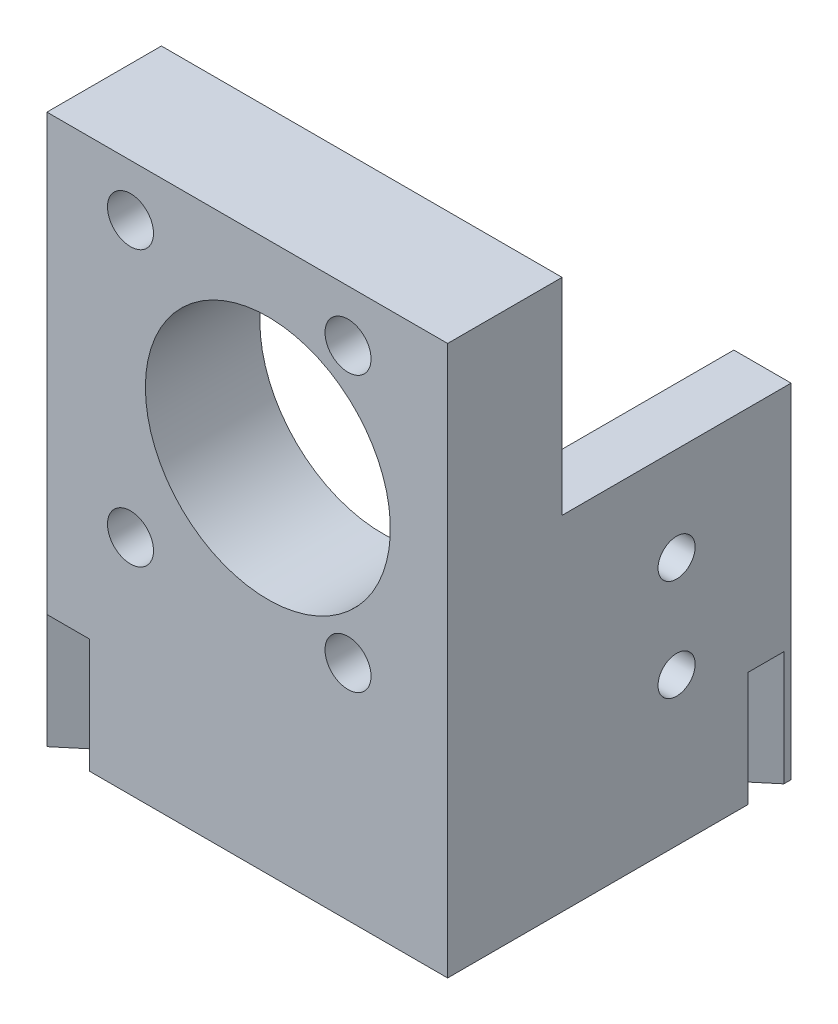
ISO-10303-21;
HEADER;
FILE_DESCRIPTION(('STEP AP214'),'2;1');
FILE_NAME('part.step','',(''),(''),'','','');
FILE_SCHEMA(('AUTOMOTIVE_DESIGN { 1 0 10303 214 1 1 1 1 }'));
ENDSEC;
DATA;
#1=APPLICATION_CONTEXT('core data for automotive mechanical design processes');
#2=APPLICATION_PROTOCOL_DEFINITION('international standard','automotive_design',2000,#1);
#3=PRODUCT_CONTEXT('',#1,'mechanical');
#4=PRODUCT('Part','Part','',(#3));
#5=PRODUCT_RELATED_PRODUCT_CATEGORY('part','',(#4));
#6=PRODUCT_DEFINITION_FORMATION('','',#4);
#7=PRODUCT_DEFINITION_CONTEXT('part definition',#1,'design');
#8=PRODUCT_DEFINITION('design','',#6,#7);
#9=PRODUCT_DEFINITION_SHAPE('','',#8);
#10=(LENGTH_UNIT() NAMED_UNIT(*) SI_UNIT(.MILLI.,.METRE.));
#11=(NAMED_UNIT(*) PLANE_ANGLE_UNIT() SI_UNIT($,.RADIAN.));
#12=(NAMED_UNIT(*) SI_UNIT($,.STERADIAN.) SOLID_ANGLE_UNIT());
#13=UNCERTAINTY_MEASURE_WITH_UNIT(LENGTH_MEASURE(1.E-05),#10,'distance_accuracy_value','');
#14=(GEOMETRIC_REPRESENTATION_CONTEXT(3) GLOBAL_UNCERTAINTY_ASSIGNED_CONTEXT((#13)) GLOBAL_UNIT_ASSIGNED_CONTEXT((#10,
#11,#12)) REPRESENTATION_CONTEXT('',''));
#15=CARTESIAN_POINT('',(0.,0.,0.));
#16=DIRECTION('',(0.,0.,1.));
#17=DIRECTION('',(1.,0.,0.));
#18=AXIS2_PLACEMENT_3D('',#15,#16,#17);
#19=CARTESIAN_POINT('',(0.,0.,0.));
#20=DIRECTION('',(0.,1.,0.));
#21=DIRECTION('',(0.,0.,1.));
#22=AXIS2_PLACEMENT_3D('',#19,#20,#21);
#23=PLANE('',#22);
#24=DIRECTION('',(1.,0.,0.));
#25=VECTOR('',#24,1.);
#26=CARTESIAN_POINT('',(-44.45,0.,0.));
#27=LINE('',#26,#25);
#28=CARTESIAN_POINT('',(-39.7081537757294,0.,0.));
#29=VERTEX_POINT('',#28);
#30=CARTESIAN_POINT('',(0.,0.,0.));
#31=VERTEX_POINT('',#30);
#32=EDGE_CURVE('E216',#29,#31,#27,.T.);
#33=ORIENTED_EDGE('',*,*,#32,.F.);
#34=DIRECTION('',(0.766044443118982,0.,-0.642787609686534));
#35=VECTOR('',#34,1.);
#36=CARTESIAN_POINT('',(-16.4064526170276,0.,-19.5524488480696));
#37=LINE('',#36,#35);
#38=CARTESIAN_POINT('',(-24.5728831497828,0.,-12.7));
#39=VERTEX_POINT('',#38);
#40=EDGE_CURVE('E43',#29,#39,#37,.T.);
#41=ORIENTED_EDGE('',*,*,#40,.T.);
#42=DIRECTION('',(-1.,0.,0.));
#43=VECTOR('',#42,1.);
#44=CARTESIAN_POINT('',(-6.35000000000001,0.,-12.7));
#45=LINE('',#44,#43);
#46=CARTESIAN_POINT('',(-6.35000000000001,0.,-12.7));
#47=VERTEX_POINT('',#46);
#48=EDGE_CURVE('E221',#47,#39,#45,.T.);
#49=ORIENTED_EDGE('',*,*,#48,.F.);
#50=DIRECTION('',(0.,0.,1.));
#51=VECTOR('',#50,1.);
#52=CARTESIAN_POINT('',(-6.35,0.,-38.1));
#53=LINE('',#52,#51);
#54=CARTESIAN_POINT('',(-6.35,0.,-27.9908145299692));
#55=VERTEX_POINT('',#54);
#56=EDGE_CURVE('E169',#55,#47,#53,.T.);
#57=ORIENTED_EDGE('',*,*,#56,.F.);
#58=CARTESIAN_POINT('',(0.,0.,-33.3190971879449));
#59=VERTEX_POINT('',#58);
#60=EDGE_CURVE('E193',#55,#59,#37,.T.);
#61=ORIENTED_EDGE('',*,*,#60,.T.);
#62=DIRECTION('',(0.,0.,-1.));
#63=VECTOR('',#62,1.);
#64=CARTESIAN_POINT('',(0.,0.,0.));
#65=LINE('',#64,#63);
#66=EDGE_CURVE('E212',#31,#59,#65,.T.);
#67=ORIENTED_EDGE('',*,*,#66,.F.);
#68=EDGE_LOOP('',(#33,#41,#49,#57,#61,#67));
#69=FACE_BOUND('',#68,.T.);
#70=ADVANCED_FACE('F35',(#69),#23,.F.);
#71=CARTESIAN_POINT('',(0.,0.,-37.2979786058297));
#72=VERTEX_POINT('',#71);
#73=CARTESIAN_POINT('',(0.,0.,-38.1));
#74=VERTEX_POINT('',#73);
#75=EDGE_CURVE('E206',#72,#74,#65,.T.);
#76=ORIENTED_EDGE('',*,*,#75,.F.);
#77=DIRECTION('',(-0.766044443118982,0.,0.642787609686535));
#78=VECTOR('',#77,1.);
#79=CARTESIAN_POINT('',(-18.3656692513522,0.,-21.8873523106963));
#80=LINE('',#79,#78);
#81=CARTESIAN_POINT('',(-6.35,0.,-31.969695947854));
#82=VERTEX_POINT('',#81);
#83=EDGE_CURVE('E192',#72,#82,#80,.T.);
#84=ORIENTED_EDGE('',*,*,#83,.T.);
#85=CARTESIAN_POINT('',(-6.35,0.,-38.1));
#86=VERTEX_POINT('',#85);
#87=EDGE_CURVE('E178',#86,#82,#53,.T.);
#88=ORIENTED_EDGE('',*,*,#87,.F.);
#89=DIRECTION('',(-1.,0.,0.));
#90=VECTOR('',#89,1.);
#91=CARTESIAN_POINT('',(0.,0.,-38.1));
#92=LINE('',#91,#90);
#93=EDGE_CURVE('E211',#74,#86,#92,.T.);
#94=ORIENTED_EDGE('',*,*,#93,.F.);
#95=EDGE_LOOP('',(#76,#84,#88,#94));
#96=FACE_BOUND('',#95,.T.);
#97=ADVANCED_FACE('F203',(#96),#23,.F.);
#98=CARTESIAN_POINT('',(-6.35000000000001,60.96,-12.7));
#99=DIRECTION('',(0.,0.,1.));
#100=DIRECTION('',(1.,0.,0.));
#101=AXIS2_PLACEMENT_3D('',#98,#99,#100);
#102=PLANE('',#101);
#103=CARTESIAN_POINT('',(-35.179,55.2196,-12.7));
#104=DIRECTION('',(0.,0.,1.));
#105=DIRECTION('',(1.,0.,0.));
#106=AXIS2_PLACEMENT_3D('',#103,#104,#105);
#107=CIRCLE('',#106,2.5527);
#108=CARTESIAN_POINT('',(-32.6263,55.2196,-12.7));
#109=VERTEX_POINT('',#108);
#110=EDGE_CURVE('E301',#109,#109,#107,.T.);
#111=ORIENTED_EDGE('',*,*,#110,.T.);
#112=EDGE_LOOP('',(#111));
#113=FACE_BOUND('',#112,.T.);
#114=CARTESIAN_POINT('',(-11.049,55.2196,-12.7));
#115=DIRECTION('',(0.,0.,1.));
#116=DIRECTION('',(1.,0.,0.));
#117=AXIS2_PLACEMENT_3D('',#114,#115,#116);
#118=CIRCLE('',#117,2.5527);
#119=CARTESIAN_POINT('',(-8.4963,55.2196,-12.7));
#120=VERTEX_POINT('',#119);
#121=EDGE_CURVE('E295',#120,#120,#118,.T.);
#122=ORIENTED_EDGE('',*,*,#121,.T.);
#123=EDGE_LOOP('',(#122));
#124=FACE_BOUND('',#123,.T.);
#125=CARTESIAN_POINT('',(-35.179,24.7396,-12.7));
#126=DIRECTION('',(0.,0.,1.));
#127=DIRECTION('',(1.,0.,0.));
#128=AXIS2_PLACEMENT_3D('',#125,#126,#127);
#129=CIRCLE('',#128,2.5527);
#130=CARTESIAN_POINT('',(-32.6263,24.7396,-12.7));
#131=VERTEX_POINT('',#130);
#132=EDGE_CURVE('E289',#131,#131,#129,.T.);
#133=ORIENTED_EDGE('',*,*,#132,.T.);
#134=EDGE_LOOP('',(#133));
#135=FACE_BOUND('',#134,.T.);
#136=CARTESIAN_POINT('',(-11.049,24.7396,-12.7));
#137=DIRECTION('',(0.,0.,1.));
#138=DIRECTION('',(1.,0.,0.));
#139=AXIS2_PLACEMENT_3D('',#136,#137,#138);
#140=CIRCLE('',#139,2.5527);
#141=CARTESIAN_POINT('',(-8.49630000000001,24.7396,-12.7));
#142=VERTEX_POINT('',#141);
#143=EDGE_CURVE('E164',#142,#142,#140,.T.);
#144=ORIENTED_EDGE('',*,*,#143,.T.);
#145=EDGE_LOOP('',(#144));
#146=FACE_BOUND('',#145,.T.);
#147=CARTESIAN_POINT('',(-19.939,39.9796,-12.7));
#148=DIRECTION('',(0.,0.,-1.));
#149=DIRECTION('',(-1.,0.,0.));
#150=AXIS2_PLACEMENT_3D('',#147,#148,#149);
#151=CIRCLE('',#150,13.589);
#152=CARTESIAN_POINT('',(-33.528,39.9796,-12.7));
#153=VERTEX_POINT('',#152);
#154=EDGE_CURVE('E239',#153,#153,#151,.T.);
#155=ORIENTED_EDGE('',*,*,#154,.F.);
#156=EDGE_LOOP('',(#155));
#157=FACE_BOUND('',#156,.T.);
#158=ORIENTED_EDGE('',*,*,#48,.T.);
#159=DIRECTION('',(0.,1.,0.));
#160=VECTOR('',#159,1.);
#161=CARTESIAN_POINT('',(-24.5728831497828,60.96,-12.7));
#162=LINE('',#161,#160);
#163=CARTESIAN_POINT('',(-24.5728831497828,12.7,-12.7));
#164=VERTEX_POINT('',#163);
#165=EDGE_CURVE('E253',#39,#164,#162,.T.);
#166=ORIENTED_EDGE('',*,*,#165,.T.);
#167=DIRECTION('',(-1.,0.,0.));
#168=VECTOR('',#167,1.);
#169=CARTESIAN_POINT('',(-6.35000000000001,12.7,-12.7));
#170=LINE('',#169,#168);
#171=CARTESIAN_POINT('',(-29.3147293740534,12.7,-12.7));
#172=VERTEX_POINT('',#171);
#173=EDGE_CURVE('E242',#164,#172,#170,.T.);
#174=ORIENTED_EDGE('',*,*,#173,.T.);
#175=DIRECTION('',(0.,-1.,0.));
#176=VECTOR('',#175,1.);
#177=CARTESIAN_POINT('',(-29.3147293740534,60.96,-12.7));
#178=LINE('',#177,#176);
#179=CARTESIAN_POINT('',(-29.3147293740534,0.,-12.7));
#180=VERTEX_POINT('',#179);
#181=EDGE_CURVE('E264',#172,#180,#178,.T.);
#182=ORIENTED_EDGE('',*,*,#181,.T.);
#183=CARTESIAN_POINT('',(-44.45,0.,-12.7));
#184=VERTEX_POINT('',#183);
#185=EDGE_CURVE('E222',#180,#184,#45,.T.);
#186=ORIENTED_EDGE('',*,*,#185,.T.);
#187=DIRECTION('',(0.,-1.,0.));
#188=VECTOR('',#187,1.);
#189=CARTESIAN_POINT('',(-44.45,60.96,-12.7));
#190=LINE('',#189,#188);
#191=CARTESIAN_POINT('',(-44.45,60.96,-12.7));
#192=VERTEX_POINT('',#191);
#193=EDGE_CURVE('E188',#192,#184,#190,.T.);
#194=ORIENTED_EDGE('',*,*,#193,.F.);
#195=DIRECTION('',(-1.,0.,0.));
#196=VECTOR('',#195,1.);
#197=CARTESIAN_POINT('',(-6.35000000000001,60.96,-12.7));
#198=LINE('',#197,#196);
#199=CARTESIAN_POINT('',(0.,60.96,-12.7));
#200=VERTEX_POINT('',#199);
#201=EDGE_CURVE('E209',#200,#192,#198,.T.);
#202=ORIENTED_EDGE('',*,*,#201,.F.);
#203=DIRECTION('',(0.,1.,0.));
#204=VECTOR('',#203,1.);
#205=CARTESIAN_POINT('',(0.,38.1,-12.7));
#206=LINE('',#205,#204);
#207=CARTESIAN_POINT('',(0.,38.1,-12.7));
#208=VERTEX_POINT('',#207);
#209=EDGE_CURVE('E152',#208,#200,#206,.T.);
#210=ORIENTED_EDGE('',*,*,#209,.F.);
#211=DIRECTION('',(1.,0.,0.));
#212=VECTOR('',#211,1.);
#213=CARTESIAN_POINT('',(-6.35000000000001,38.1,-12.7));
#214=LINE('',#213,#212);
#215=CARTESIAN_POINT('',(-6.35000000000001,38.1,-12.7));
#216=VERTEX_POINT('',#215);
#217=EDGE_CURVE('E149',#216,#208,#214,.T.);
#218=ORIENTED_EDGE('',*,*,#217,.F.);
#219=DIRECTION('',(0.,-1.,0.));
#220=VECTOR('',#219,1.);
#221=CARTESIAN_POINT('',(-6.35000000000001,60.96,-12.7));
#222=LINE('',#221,#220);
#223=EDGE_CURVE('E86',#216,#47,#222,.T.);
#224=ORIENTED_EDGE('',*,*,#223,.T.);
#225=EDGE_LOOP('',(#158,#166,#174,#182,#186,#194,#202,#210,#218,#224));
#226=FACE_BOUND('',#225,.T.);
#227=ADVANCED_FACE('F37',(#113,#124,#135,#146,#157,#226),#102,.F.);
#228=CARTESIAN_POINT('',(-44.45,60.96,-12.7));
#229=DIRECTION('',(1.,0.,0.));
#230=DIRECTION('',(0.,0.,-1.));
#231=AXIS2_PLACEMENT_3D('',#228,#229,#230);
#232=PLANE('',#231);
#233=DIRECTION('',(0.,0.,1.));
#234=VECTOR('',#233,1.);
#235=CARTESIAN_POINT('',(-44.45,0.,-12.7));
#236=LINE('',#235,#234);
#237=CARTESIAN_POINT('',(-44.45,0.,0.));
#238=VERTEX_POINT('',#237);
#239=EDGE_CURVE('E218',#184,#238,#236,.T.);
#240=ORIENTED_EDGE('',*,*,#239,.T.);
#241=DIRECTION('',(0.,1.,0.));
#242=VECTOR('',#241,1.);
#243=CARTESIAN_POINT('',(-44.45,60.96,0.));
#244=LINE('',#243,#242);
#245=CARTESIAN_POINT('',(-44.45,12.7,0.));
#246=VERTEX_POINT('',#245);
#247=EDGE_CURVE('E267',#238,#246,#244,.T.);
#248=ORIENTED_EDGE('',*,*,#247,.T.);
#249=DIRECTION('',(0.,-1.,0.));
#250=VECTOR('',#249,1.);
#251=CARTESIAN_POINT('',(-44.45,60.96,0.));
#252=LINE('',#251,#250);
#253=CARTESIAN_POINT('',(-44.45,60.96,0.));
#254=VERTEX_POINT('',#253);
#255=EDGE_CURVE('E185',#254,#246,#252,.T.);
#256=ORIENTED_EDGE('',*,*,#255,.F.);
#257=DIRECTION('',(0.,0.,1.));
#258=VECTOR('',#257,1.);
#259=CARTESIAN_POINT('',(-44.45,60.96,-12.7));
#260=LINE('',#259,#258);
#261=EDGE_CURVE('E92',#192,#254,#260,.T.);
#262=ORIENTED_EDGE('',*,*,#261,.F.);
#263=ORIENTED_EDGE('',*,*,#193,.T.);
#264=EDGE_LOOP('',(#240,#248,#256,#262,#263));
#265=FACE_BOUND('',#264,.T.);
#266=ADVANCED_FACE('F315',(#265),#232,.F.);
#267=CARTESIAN_POINT('',(-44.45,60.96,0.));
#268=DIRECTION('',(0.,0.,-1.));
#269=DIRECTION('',(-1.,0.,0.));
#270=AXIS2_PLACEMENT_3D('',#267,#268,#269);
#271=PLANE('',#270);
#272=CARTESIAN_POINT('',(-35.179,55.2196,0.));
#273=DIRECTION('',(0.,0.,1.));
#274=DIRECTION('',(1.,0.,0.));
#275=AXIS2_PLACEMENT_3D('',#272,#273,#274);
#276=CIRCLE('',#275,2.5527);
#277=CARTESIAN_POINT('',(-32.6263,55.2196,0.));
#278=VERTEX_POINT('',#277);
#279=EDGE_CURVE('E304',#278,#278,#276,.T.);
#280=ORIENTED_EDGE('',*,*,#279,.F.);
#281=EDGE_LOOP('',(#280));
#282=FACE_BOUND('',#281,.T.);
#283=CARTESIAN_POINT('',(-11.049,55.2196,0.));
#284=DIRECTION('',(0.,0.,1.));
#285=DIRECTION('',(1.,0.,0.));
#286=AXIS2_PLACEMENT_3D('',#283,#284,#285);
#287=CIRCLE('',#286,2.5527);
#288=CARTESIAN_POINT('',(-8.4963,55.2196,0.));
#289=VERTEX_POINT('',#288);
#290=EDGE_CURVE('E298',#289,#289,#287,.T.);
#291=ORIENTED_EDGE('',*,*,#290,.F.);
#292=EDGE_LOOP('',(#291));
#293=FACE_BOUND('',#292,.T.);
#294=CARTESIAN_POINT('',(-35.179,24.7396,0.));
#295=DIRECTION('',(0.,0.,1.));
#296=DIRECTION('',(1.,0.,0.));
#297=AXIS2_PLACEMENT_3D('',#294,#295,#296);
#298=CIRCLE('',#297,2.5527);
#299=CARTESIAN_POINT('',(-32.6263,24.7396,0.));
#300=VERTEX_POINT('',#299);
#301=EDGE_CURVE('E292',#300,#300,#298,.T.);
#302=ORIENTED_EDGE('',*,*,#301,.F.);
#303=EDGE_LOOP('',(#302));
#304=FACE_BOUND('',#303,.T.);
#305=CARTESIAN_POINT('',(-11.049,24.7396,0.));
#306=DIRECTION('',(0.,0.,1.));
#307=DIRECTION('',(1.,0.,0.));
#308=AXIS2_PLACEMENT_3D('',#305,#306,#307);
#309=CIRCLE('',#308,2.5527);
#310=CARTESIAN_POINT('',(-8.49630000000001,24.7396,0.));
#311=VERTEX_POINT('',#310);
#312=EDGE_CURVE('E286',#311,#311,#309,.T.);
#313=ORIENTED_EDGE('',*,*,#312,.F.);
#314=EDGE_LOOP('',(#313));
#315=FACE_BOUND('',#314,.T.);
#316=CARTESIAN_POINT('',(-19.939,39.9796,0.));
#317=DIRECTION('',(0.,0.,-1.));
#318=DIRECTION('',(-1.,0.,0.));
#319=AXIS2_PLACEMENT_3D('',#316,#317,#318);
#320=CIRCLE('',#319,13.589);
#321=CARTESIAN_POINT('',(-33.528,39.9796,0.));
#322=VERTEX_POINT('',#321);
#323=EDGE_CURVE('E236',#322,#322,#320,.T.);
#324=ORIENTED_EDGE('',*,*,#323,.T.);
#325=EDGE_LOOP('',(#324));
#326=FACE_BOUND('',#325,.T.);
#327=DIRECTION('',(1.,0.,0.));
#328=VECTOR('',#327,1.);
#329=CARTESIAN_POINT('',(-44.45,12.7,0.));
#330=LINE('',#329,#328);
#331=CARTESIAN_POINT('',(-39.7081537757294,12.7,0.));
#332=VERTEX_POINT('',#331);
#333=EDGE_CURVE('E247',#246,#332,#330,.T.);
#334=ORIENTED_EDGE('',*,*,#333,.T.);
#335=DIRECTION('',(0.,-1.,0.));
#336=VECTOR('',#335,1.);
#337=CARTESIAN_POINT('',(-39.7081537757294,60.96,0.));
#338=LINE('',#337,#336);
#339=EDGE_CURVE('E256',#332,#29,#338,.T.);
#340=ORIENTED_EDGE('',*,*,#339,.T.);
#341=ORIENTED_EDGE('',*,*,#32,.T.);
#342=DIRECTION('',(0.,-1.,0.));
#343=VECTOR('',#342,1.);
#344=CARTESIAN_POINT('',(0.,60.96,0.));
#345=LINE('',#344,#343);
#346=CARTESIAN_POINT('',(0.,60.96,0.));
#347=VERTEX_POINT('',#346);
#348=EDGE_CURVE('E182',#347,#31,#345,.T.);
#349=ORIENTED_EDGE('',*,*,#348,.F.);
#350=DIRECTION('',(1.,0.,0.));
#351=VECTOR('',#350,1.);
#352=CARTESIAN_POINT('',(-44.45,60.96,0.));
#353=LINE('',#352,#351);
#354=EDGE_CURVE('E59',#254,#347,#353,.T.);
#355=ORIENTED_EDGE('',*,*,#354,.F.);
#356=ORIENTED_EDGE('',*,*,#255,.T.);
#357=EDGE_LOOP('',(#334,#340,#341,#349,#355,#356));
#358=FACE_BOUND('',#357,.T.);
#359=ADVANCED_FACE('F311',(#282,#293,#304,#315,#326,#358),#271,.F.);
#360=CARTESIAN_POINT('',(0.,60.96,0.));
#361=DIRECTION('',(-1.,0.,0.));
#362=DIRECTION('',(0.,0.,1.));
#363=AXIS2_PLACEMENT_3D('',#360,#361,#362);
#364=PLANE('',#363);
#365=DIRECTION('',(0.,0.,-1.));
#366=VECTOR('',#365,1.);
#367=CARTESIAN_POINT('',(0.,38.1,-12.7));
#368=LINE('',#367,#366);
#369=CARTESIAN_POINT('',(0.,38.1,-38.1));
#370=VERTEX_POINT('',#369);
#371=EDGE_CURVE('E155',#208,#370,#368,.T.);
#372=ORIENTED_EDGE('',*,*,#371,.F.);
#373=ORIENTED_EDGE('',*,*,#209,.T.);
#374=DIRECTION('',(0.,0.,-1.));
#375=VECTOR('',#374,1.);
#376=CARTESIAN_POINT('',(0.,60.96,0.));
#377=LINE('',#376,#375);
#378=EDGE_CURVE('E172',#347,#200,#377,.T.);
#379=ORIENTED_EDGE('',*,*,#378,.F.);
#380=ORIENTED_EDGE('',*,*,#348,.T.);
#381=ORIENTED_EDGE('',*,*,#66,.T.);
#382=DIRECTION('',(0.,1.,0.));
#383=VECTOR('',#382,1.);
#384=CARTESIAN_POINT('',(0.,60.96,-33.3190971879449));
#385=LINE('',#384,#383);
#386=CARTESIAN_POINT('',(0.,12.7,-33.3190971879449));
#387=VERTEX_POINT('',#386);
#388=EDGE_CURVE('E259',#59,#387,#385,.T.);
#389=ORIENTED_EDGE('',*,*,#388,.T.);
#390=DIRECTION('',(0.,0.,-1.));
#391=VECTOR('',#390,1.);
#392=CARTESIAN_POINT('',(0.,12.7,0.));
#393=LINE('',#392,#391);
#394=CARTESIAN_POINT('',(0.,12.7,-37.2979786058297));
#395=VERTEX_POINT('',#394);
#396=EDGE_CURVE('E250',#387,#395,#393,.T.);
#397=ORIENTED_EDGE('',*,*,#396,.T.);
#398=DIRECTION('',(0.,-1.,0.));
#399=VECTOR('',#398,1.);
#400=CARTESIAN_POINT('',(0.,60.96,-37.2979786058297));
#401=LINE('',#400,#399);
#402=EDGE_CURVE('E270',#395,#72,#401,.T.);
#403=ORIENTED_EDGE('',*,*,#402,.T.);
#404=ORIENTED_EDGE('',*,*,#75,.T.);
#405=DIRECTION('',(0.,-1.,0.));
#406=VECTOR('',#405,1.);
#407=CARTESIAN_POINT('',(0.,60.96,-38.1));
#408=LINE('',#407,#406);
#409=EDGE_CURVE('E174',#370,#74,#408,.T.);
#410=ORIENTED_EDGE('',*,*,#409,.F.);
#411=EDGE_LOOP('',(#372,#373,#379,#380,#381,#389,#397,#403,#404,#410));
#412=FACE_BOUND('',#411,.T.);
#413=CARTESIAN_POINT('',(0.,27.686,-25.4));
#414=DIRECTION('',(-1.,0.,0.));
#415=DIRECTION('',(0.,0.,1.));
#416=AXIS2_PLACEMENT_3D('',#413,#414,#415);
#417=CIRCLE('',#416,2.0574);
#418=CARTESIAN_POINT('',(0.,27.686,-23.3426));
#419=VERTEX_POINT('',#418);
#420=EDGE_CURVE('E230',#419,#419,#417,.T.);
#421=ORIENTED_EDGE('',*,*,#420,.T.);
#422=EDGE_LOOP('',(#421));
#423=FACE_BOUND('',#422,.T.);
#424=CARTESIAN_POINT('',(0.,16.4338,-25.4));
#425=DIRECTION('',(-1.,0.,0.));
#426=DIRECTION('',(0.,0.,1.));
#427=AXIS2_PLACEMENT_3D('',#424,#425,#426);
#428=CIRCLE('',#427,2.0574);
#429=CARTESIAN_POINT('',(0.,16.4338,-23.3426));
#430=VERTEX_POINT('',#429);
#431=EDGE_CURVE('E229',#430,#430,#428,.T.);
#432=ORIENTED_EDGE('',*,*,#431,.T.);
#433=EDGE_LOOP('',(#432));
#434=FACE_BOUND('',#433,.T.);
#435=ADVANCED_FACE('F314',(#412,#423,#434),#364,.F.);
#436=CARTESIAN_POINT('',(0.,60.96,-38.1));
#437=DIRECTION('',(0.,0.,1.));
#438=DIRECTION('',(1.,0.,0.));
#439=AXIS2_PLACEMENT_3D('',#436,#437,#438);
#440=PLANE('',#439);
#441=DIRECTION('',(0.,-1.,0.));
#442=VECTOR('',#441,1.);
#443=CARTESIAN_POINT('',(-6.35,60.96,-38.1));
#444=LINE('',#443,#442);
#445=CARTESIAN_POINT('',(-6.35000000000001,38.1,-38.1));
#446=VERTEX_POINT('',#445);
#447=EDGE_CURVE('E171',#446,#86,#444,.T.);
#448=ORIENTED_EDGE('',*,*,#447,.F.);
#449=DIRECTION('',(-1.,0.,0.));
#450=VECTOR('',#449,1.);
#451=CARTESIAN_POINT('',(-6.35000000000001,38.1,-38.1));
#452=LINE('',#451,#450);
#453=EDGE_CURVE('E161',#370,#446,#452,.T.);
#454=ORIENTED_EDGE('',*,*,#453,.F.);
#455=ORIENTED_EDGE('',*,*,#409,.T.);
#456=ORIENTED_EDGE('',*,*,#93,.T.);
#457=EDGE_LOOP('',(#448,#454,#455,#456));
#458=FACE_BOUND('',#457,.T.);
#459=ADVANCED_FACE('F352',(#458),#440,.F.);
#460=CARTESIAN_POINT('',(-6.35,60.96,-38.1));
#461=DIRECTION('',(1.,0.,0.));
#462=DIRECTION('',(0.,0.,-1.));
#463=AXIS2_PLACEMENT_3D('',#460,#461,#462);
#464=PLANE('',#463);
#465=CARTESIAN_POINT('',(-6.35000000000002,27.686,-25.4));
#466=DIRECTION('',(-1.,0.,0.));
#467=DIRECTION('',(0.,0.,1.));
#468=AXIS2_PLACEMENT_3D('',#465,#466,#467);
#469=CIRCLE('',#468,2.0574);
#470=CARTESIAN_POINT('',(-6.35000000000002,27.686,-23.3426));
#471=VERTEX_POINT('',#470);
#472=EDGE_CURVE('E233',#471,#471,#469,.T.);
#473=ORIENTED_EDGE('',*,*,#472,.F.);
#474=EDGE_LOOP('',(#473));
#475=FACE_BOUND('',#474,.T.);
#476=CARTESIAN_POINT('',(-6.35000000000002,16.4338,-25.4));
#477=DIRECTION('',(-1.,0.,0.));
#478=DIRECTION('',(0.,0.,1.));
#479=AXIS2_PLACEMENT_3D('',#476,#477,#478);
#480=CIRCLE('',#479,2.0574);
#481=CARTESIAN_POINT('',(-6.35000000000002,16.4338,-23.3426));
#482=VERTEX_POINT('',#481);
#483=EDGE_CURVE('E226',#482,#482,#480,.T.);
#484=ORIENTED_EDGE('',*,*,#483,.F.);
#485=EDGE_LOOP('',(#484));
#486=FACE_BOUND('',#485,.T.);
#487=ORIENTED_EDGE('',*,*,#223,.F.);
#488=DIRECTION('',(0.,0.,1.));
#489=VECTOR('',#488,1.);
#490=CARTESIAN_POINT('',(-6.35000000000001,38.1,-12.7));
#491=LINE('',#490,#489);
#492=EDGE_CURVE('E156',#446,#216,#491,.T.);
#493=ORIENTED_EDGE('',*,*,#492,.F.);
#494=ORIENTED_EDGE('',*,*,#447,.T.);
#495=ORIENTED_EDGE('',*,*,#87,.T.);
#496=DIRECTION('',(0.,1.,0.));
#497=VECTOR('',#496,1.);
#498=CARTESIAN_POINT('',(-6.35,60.96,-31.969695947854));
#499=LINE('',#498,#497);
#500=CARTESIAN_POINT('',(-6.35,12.7,-31.969695947854));
#501=VERTEX_POINT('',#500);
#502=EDGE_CURVE('E50',#82,#501,#499,.T.);
#503=ORIENTED_EDGE('',*,*,#502,.T.);
#504=DIRECTION('',(0.,0.,1.));
#505=VECTOR('',#504,1.);
#506=CARTESIAN_POINT('',(-6.35,12.7,-38.1));
#507=LINE('',#506,#505);
#508=CARTESIAN_POINT('',(-6.35,12.7,-27.9908145299692));
#509=VERTEX_POINT('',#508);
#510=EDGE_CURVE('E11',#501,#509,#507,.T.);
#511=ORIENTED_EDGE('',*,*,#510,.T.);
#512=DIRECTION('',(0.,-1.,0.));
#513=VECTOR('',#512,1.);
#514=CARTESIAN_POINT('',(-6.35,60.96,-27.9908145299692));
#515=LINE('',#514,#513);
#516=EDGE_CURVE('E262',#509,#55,#515,.T.);
#517=ORIENTED_EDGE('',*,*,#516,.T.);
#518=ORIENTED_EDGE('',*,*,#56,.T.);
#519=EDGE_LOOP('',(#487,#493,#494,#495,#503,#511,#517,#518));
#520=FACE_BOUND('',#519,.T.);
#521=ADVANCED_FACE('F166',(#475,#486,#520),#464,.F.);
#522=CARTESIAN_POINT('',(0.,60.96,0.));
#523=DIRECTION('',(0.,1.,0.));
#524=DIRECTION('',(0.,0.,1.));
#525=AXIS2_PLACEMENT_3D('',#522,#523,#524);
#526=PLANE('',#525);
#527=ORIENTED_EDGE('',*,*,#378,.T.);
#528=ORIENTED_EDGE('',*,*,#201,.T.);
#529=ORIENTED_EDGE('',*,*,#261,.T.);
#530=ORIENTED_EDGE('',*,*,#354,.T.);
#531=EDGE_LOOP('',(#527,#528,#529,#530));
#532=FACE_BOUND('',#531,.T.);
#533=ADVANCED_FACE('F343',(#532),#526,.T.);
#534=ORIENTED_EDGE('',*,*,#185,.F.);
#535=EDGE_CURVE('E190',#180,#238,#80,.T.);
#536=ORIENTED_EDGE('',*,*,#535,.T.);
#537=ORIENTED_EDGE('',*,*,#239,.F.);
#538=EDGE_LOOP('',(#534,#536,#537));
#539=FACE_BOUND('',#538,.T.);
#540=ADVANCED_FACE('F337',(#539),#23,.F.);
#541=CARTESIAN_POINT('',(0.,16.4338,-25.4));
#542=DIRECTION('',(-1.,0.,0.));
#543=DIRECTION('',(0.,0.,1.));
#544=AXIS2_PLACEMENT_3D('',#541,#542,#543);
#545=CYLINDRICAL_SURFACE('',#544,2.0574);
#546=ORIENTED_EDGE('',*,*,#431,.F.);
#547=EDGE_LOOP('',(#546));
#548=FACE_BOUND('',#547,.T.);
#549=ORIENTED_EDGE('',*,*,#483,.T.);
#550=EDGE_LOOP('',(#549));
#551=FACE_BOUND('',#550,.T.);
#552=ADVANCED_FACE('F350',(#548,#551),#545,.F.);
#553=CARTESIAN_POINT('',(0.,27.686,-25.4));
#554=DIRECTION('',(-1.,0.,0.));
#555=DIRECTION('',(0.,0.,1.));
#556=AXIS2_PLACEMENT_3D('',#553,#554,#555);
#557=CYLINDRICAL_SURFACE('',#556,2.0574);
#558=ORIENTED_EDGE('',*,*,#420,.F.);
#559=EDGE_LOOP('',(#558));
#560=FACE_BOUND('',#559,.T.);
#561=ORIENTED_EDGE('',*,*,#472,.T.);
#562=EDGE_LOOP('',(#561));
#563=FACE_BOUND('',#562,.T.);
#564=ADVANCED_FACE('F383',(#560,#563),#557,.F.);
#565=CARTESIAN_POINT('',(-19.939,39.9796,0.));
#566=DIRECTION('',(0.,0.,-1.));
#567=DIRECTION('',(-1.,0.,0.));
#568=AXIS2_PLACEMENT_3D('',#565,#566,#567);
#569=CYLINDRICAL_SURFACE('',#568,13.589);
#570=ORIENTED_EDGE('',*,*,#323,.F.);
#571=EDGE_LOOP('',(#570));
#572=FACE_BOUND('',#571,.T.);
#573=ORIENTED_EDGE('',*,*,#154,.T.);
#574=EDGE_LOOP('',(#573));
#575=FACE_BOUND('',#574,.T.);
#576=ADVANCED_FACE('F381',(#572,#575),#569,.F.);
#577=CARTESIAN_POINT('',(8.52226170082824,12.7,-44.4490052557908));
#578=DIRECTION('',(-0.642787609686535,0.,-0.766044443118982));
#579=DIRECTION('',(-0.766044443118982,0.,0.642787609686535));
#580=AXIS2_PLACEMENT_3D('',#577,#578,#579);
#581=PLANE('',#580);
#582=DIRECTION('',(0.766044443118982,0.,-0.642787609686535));
#583=VECTOR('',#582,1.);
#584=CARTESIAN_POINT('',(8.52226170082824,12.7,-44.4490052557908));
#585=LINE('',#584,#583);
#586=EDGE_CURVE('E277',#246,#172,#585,.T.);
#587=ORIENTED_EDGE('',*,*,#586,.F.);
#588=ORIENTED_EDGE('',*,*,#247,.F.);
#589=ORIENTED_EDGE('',*,*,#535,.F.);
#590=ORIENTED_EDGE('',*,*,#181,.F.);
#591=EDGE_LOOP('',(#587,#588,#589,#590));
#592=FACE_BOUND('',#591,.T.);
#593=ADVANCED_FACE('F332',(#592),#581,.F.);
#594=CARTESIAN_POINT('',(-47.8911082305136,12.7,6.86631406494981));
#595=DIRECTION('',(0.642787609686534,0.,0.766044443118982));
#596=DIRECTION('',(0.766044443118982,0.,-0.642787609686534));
#597=AXIS2_PLACEMENT_3D('',#594,#595,#596);
#598=PLANE('',#597);
#599=ORIENTED_EDGE('',*,*,#40,.F.);
#600=ORIENTED_EDGE('',*,*,#339,.F.);
#601=DIRECTION('',(-0.766044443118982,0.,0.642787609686534));
#602=VECTOR('',#601,1.);
#603=CARTESIAN_POINT('',(-47.8911082305136,12.7,6.86631406494981));
#604=LINE('',#603,#602);
#605=EDGE_CURVE('E274',#164,#332,#604,.T.);
#606=ORIENTED_EDGE('',*,*,#605,.F.);
#607=ORIENTED_EDGE('',*,*,#165,.F.);
#608=EDGE_LOOP('',(#599,#600,#606,#607));
#609=FACE_BOUND('',#608,.T.);
#610=ADVANCED_FACE('F339',(#609),#598,.F.);
#611=CARTESIAN_POINT('',(0.,12.7,0.));
#612=DIRECTION('',(0.,1.,0.));
#613=DIRECTION('',(0.,0.,1.));
#614=AXIS2_PLACEMENT_3D('',#611,#612,#613);
#615=PLANE('',#614);
#616=ORIENTED_EDGE('',*,*,#605,.T.);
#617=ORIENTED_EDGE('',*,*,#333,.F.);
#618=ORIENTED_EDGE('',*,*,#586,.T.);
#619=ORIENTED_EDGE('',*,*,#173,.F.);
#620=EDGE_LOOP('',(#616,#617,#618,#619));
#621=FACE_BOUND('',#620,.T.);
#622=ADVANCED_FACE('F329',(#621),#615,.F.);
#623=EDGE_CURVE('E273',#387,#509,#604,.T.);
#624=ORIENTED_EDGE('',*,*,#623,.T.);
#625=ORIENTED_EDGE('',*,*,#510,.F.);
#626=EDGE_CURVE('E278',#501,#395,#585,.T.);
#627=ORIENTED_EDGE('',*,*,#626,.T.);
#628=ORIENTED_EDGE('',*,*,#396,.F.);
#629=EDGE_LOOP('',(#624,#625,#627,#628));
#630=FACE_BOUND('',#629,.T.);
#631=ADVANCED_FACE('F455',(#630),#615,.F.);
#632=ORIENTED_EDGE('',*,*,#60,.F.);
#633=ORIENTED_EDGE('',*,*,#516,.F.);
#634=ORIENTED_EDGE('',*,*,#623,.F.);
#635=ORIENTED_EDGE('',*,*,#388,.F.);
#636=EDGE_LOOP('',(#632,#633,#634,#635));
#637=FACE_BOUND('',#636,.T.);
#638=ADVANCED_FACE('F447',(#637),#598,.F.);
#639=ORIENTED_EDGE('',*,*,#626,.F.);
#640=ORIENTED_EDGE('',*,*,#502,.F.);
#641=ORIENTED_EDGE('',*,*,#83,.F.);
#642=ORIENTED_EDGE('',*,*,#402,.F.);
#643=EDGE_LOOP('',(#639,#640,#641,#642));
#644=FACE_BOUND('',#643,.T.);
#645=ADVANCED_FACE('F391',(#644),#581,.F.);
#646=CARTESIAN_POINT('',(0.,38.1,0.));
#647=DIRECTION('',(0.,-1.,0.));
#648=DIRECTION('',(0.,0.,-1.));
#649=AXIS2_PLACEMENT_3D('',#646,#647,#648);
#650=PLANE('',#649);
#651=ORIENTED_EDGE('',*,*,#492,.T.);
#652=ORIENTED_EDGE('',*,*,#217,.T.);
#653=ORIENTED_EDGE('',*,*,#371,.T.);
#654=ORIENTED_EDGE('',*,*,#453,.T.);
#655=EDGE_LOOP('',(#651,#652,#653,#654));
#656=FACE_BOUND('',#655,.T.);
#657=ADVANCED_FACE('F159',(#656),#650,.F.);
#658=CARTESIAN_POINT('',(-11.049,24.7396,0.));
#659=DIRECTION('',(0.,0.,1.));
#660=DIRECTION('',(1.,0.,0.));
#661=AXIS2_PLACEMENT_3D('',#658,#659,#660);
#662=CYLINDRICAL_SURFACE('',#661,2.5527);
#663=ORIENTED_EDGE('',*,*,#312,.T.);
#664=EDGE_LOOP('',(#663));
#665=FACE_BOUND('',#664,.T.);
#666=ORIENTED_EDGE('',*,*,#143,.F.);
#667=EDGE_LOOP('',(#666));
#668=FACE_BOUND('',#667,.T.);
#669=ADVANCED_FACE('F511',(#665,#668),#662,.F.);
#670=CARTESIAN_POINT('',(-35.179,24.7396,0.));
#671=DIRECTION('',(0.,0.,1.));
#672=DIRECTION('',(1.,0.,0.));
#673=AXIS2_PLACEMENT_3D('',#670,#671,#672);
#674=CYLINDRICAL_SURFACE('',#673,2.5527);
#675=ORIENTED_EDGE('',*,*,#301,.T.);
#676=EDGE_LOOP('',(#675));
#677=FACE_BOUND('',#676,.T.);
#678=ORIENTED_EDGE('',*,*,#132,.F.);
#679=EDGE_LOOP('',(#678));
#680=FACE_BOUND('',#679,.T.);
#681=ADVANCED_FACE('F530',(#677,#680),#674,.F.);
#682=CARTESIAN_POINT('',(-11.049,55.2196,0.));
#683=DIRECTION('',(0.,0.,1.));
#684=DIRECTION('',(1.,0.,0.));
#685=AXIS2_PLACEMENT_3D('',#682,#683,#684);
#686=CYLINDRICAL_SURFACE('',#685,2.5527);
#687=ORIENTED_EDGE('',*,*,#290,.T.);
#688=EDGE_LOOP('',(#687));
#689=FACE_BOUND('',#688,.T.);
#690=ORIENTED_EDGE('',*,*,#121,.F.);
#691=EDGE_LOOP('',(#690));
#692=FACE_BOUND('',#691,.T.);
#693=ADVANCED_FACE('F541',(#689,#692),#686,.F.);
#694=CARTESIAN_POINT('',(-35.179,55.2196,0.));
#695=DIRECTION('',(0.,0.,1.));
#696=DIRECTION('',(1.,0.,0.));
#697=AXIS2_PLACEMENT_3D('',#694,#695,#696);
#698=CYLINDRICAL_SURFACE('',#697,2.5527);
#699=ORIENTED_EDGE('',*,*,#279,.T.);
#700=EDGE_LOOP('',(#699));
#701=FACE_BOUND('',#700,.T.);
#702=ORIENTED_EDGE('',*,*,#110,.F.);
#703=EDGE_LOOP('',(#702));
#704=FACE_BOUND('',#703,.T.);
#705=ADVANCED_FACE('F308',(#701,#704),#698,.F.);
#706=CLOSED_SHELL('',(#70,#97,#227,#266,#359,#435,#459,#521,#533,#540,#552,#564,#576,#593,#610,
#622,#631,#638,#645,#657,#669,#681,#693,#705));
#707=MANIFOLD_SOLID_BREP('B2',#706);
#708=ADVANCED_BREP_SHAPE_REPRESENTATION('',(#18,#707),#14);
#709=SHAPE_DEFINITION_REPRESENTATION(#9,#708);
ENDSEC;
END-ISO-10303-21;
